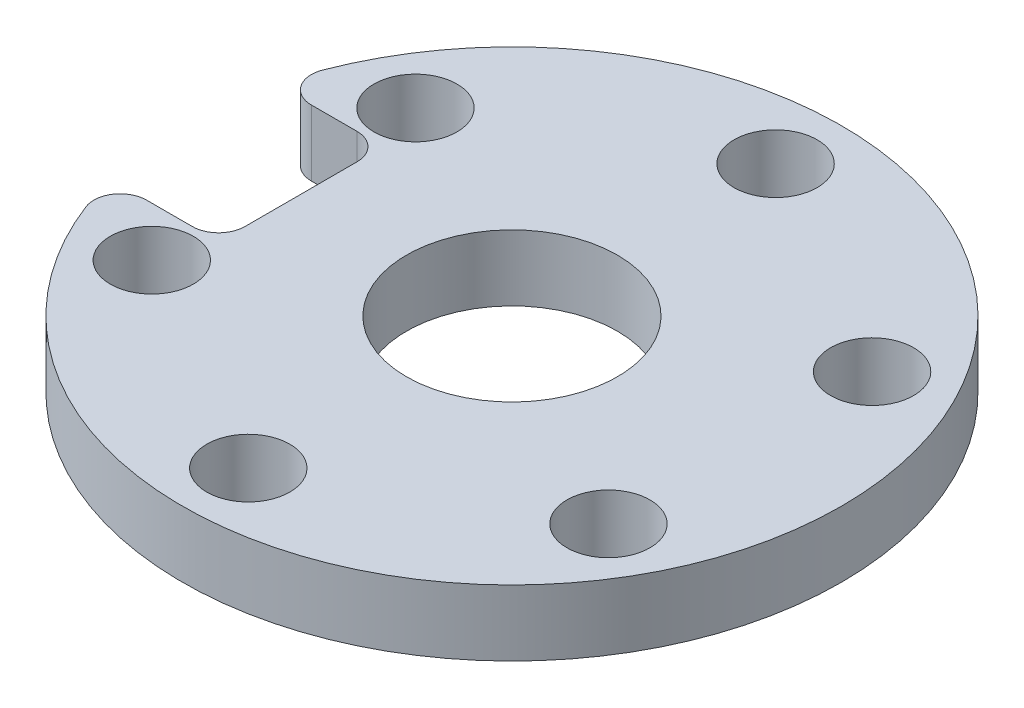
ISO-10303-21;
HEADER;
FILE_DESCRIPTION(('STEP AP214'),'2;1');
FILE_NAME('part.step','',(''),(''),'','','');
FILE_SCHEMA(('AUTOMOTIVE_DESIGN { 1 0 10303 214 1 1 1 1 }'));
ENDSEC;
DATA;
#1=APPLICATION_CONTEXT('core data for automotive mechanical design processes');
#2=APPLICATION_PROTOCOL_DEFINITION('international standard','automotive_design',2000,#1);
#3=PRODUCT_CONTEXT('',#1,'mechanical');
#4=PRODUCT('Part','Part','',(#3));
#5=PRODUCT_RELATED_PRODUCT_CATEGORY('part','',(#4));
#6=PRODUCT_DEFINITION_FORMATION('','',#4);
#7=PRODUCT_DEFINITION_CONTEXT('part definition',#1,'design');
#8=PRODUCT_DEFINITION('design','',#6,#7);
#9=PRODUCT_DEFINITION_SHAPE('','',#8);
#10=(LENGTH_UNIT() NAMED_UNIT(*) SI_UNIT(.MILLI.,.METRE.));
#11=(NAMED_UNIT(*) PLANE_ANGLE_UNIT() SI_UNIT($,.RADIAN.));
#12=(NAMED_UNIT(*) SI_UNIT($,.STERADIAN.) SOLID_ANGLE_UNIT());
#13=UNCERTAINTY_MEASURE_WITH_UNIT(LENGTH_MEASURE(1.E-05),#10,'distance_accuracy_value','');
#14=(GEOMETRIC_REPRESENTATION_CONTEXT(3) GLOBAL_UNCERTAINTY_ASSIGNED_CONTEXT((#13)) GLOBAL_UNIT_ASSIGNED_CONTEXT((#10,
#11,#12)) REPRESENTATION_CONTEXT('',''));
#15=CARTESIAN_POINT('',(0.,0.,0.));
#16=DIRECTION('',(0.,0.,1.));
#17=DIRECTION('',(1.,0.,0.));
#18=AXIS2_PLACEMENT_3D('',#15,#16,#17);
#19=CARTESIAN_POINT('',(0.,5.,0.));
#20=DIRECTION('',(0.,1.,0.));
#21=DIRECTION('',(0.,0.,1.));
#22=AXIS2_PLACEMENT_3D('',#19,#20,#21);
#23=PLANE('',#22);
#24=CARTESIAN_POINT('',(0.,5.,0.));
#25=DIRECTION('',(0.,1.,0.));
#26=DIRECTION('',(0.,0.,1.));
#27=AXIS2_PLACEMENT_3D('',#24,#25,#26);
#28=CIRCLE('',#27,8.);
#29=CARTESIAN_POINT('',(0.,5.,8.));
#30=VERTEX_POINT('',#29);
#31=EDGE_CURVE('E140',#30,#30,#28,.T.);
#32=ORIENTED_EDGE('',*,*,#31,.F.);
#33=EDGE_LOOP('',(#32));
#34=FACE_BOUND('',#33,.T.);
#35=CARTESIAN_POINT('',(-17.3205080756888,5.,10.));
#36=DIRECTION('',(0.,1.,0.));
#37=DIRECTION('',(0.,0.,1.));
#38=AXIS2_PLACEMENT_3D('',#35,#36,#37);
#39=CIRCLE('',#38,3.15);
#40=CARTESIAN_POINT('',(-17.3205080756888,5.,13.15));
#41=VERTEX_POINT('',#40);
#42=EDGE_CURVE('E155',#41,#41,#39,.T.);
#43=ORIENTED_EDGE('',*,*,#42,.F.);
#44=EDGE_LOOP('',(#43));
#45=FACE_BOUND('',#44,.T.);
#46=CARTESIAN_POINT('',(17.3205080756888,5.,10.));
#47=DIRECTION('',(0.,1.,0.));
#48=DIRECTION('',(0.,0.,1.));
#49=AXIS2_PLACEMENT_3D('',#46,#47,#48);
#50=CIRCLE('',#49,3.15);
#51=CARTESIAN_POINT('',(17.3205080756888,5.,13.15));
#52=VERTEX_POINT('',#51);
#53=EDGE_CURVE('E167',#52,#52,#50,.T.);
#54=ORIENTED_EDGE('',*,*,#53,.F.);
#55=EDGE_LOOP('',(#54));
#56=FACE_BOUND('',#55,.T.);
#57=CARTESIAN_POINT('',(0.,5.,-20.));
#58=DIRECTION('',(0.,1.,0.));
#59=DIRECTION('',(0.,0.,1.));
#60=AXIS2_PLACEMENT_3D('',#57,#58,#59);
#61=CIRCLE('',#60,3.15);
#62=CARTESIAN_POINT('',(0.,5.,-16.85));
#63=VERTEX_POINT('',#62);
#64=EDGE_CURVE('E179',#63,#63,#61,.T.);
#65=ORIENTED_EDGE('',*,*,#64,.F.);
#66=EDGE_LOOP('',(#65));
#67=FACE_BOUND('',#66,.T.);
#68=CARTESIAN_POINT('',(17.3205080756888,5.,-10.));
#69=DIRECTION('',(0.,1.,0.));
#70=DIRECTION('',(0.,0.,1.));
#71=AXIS2_PLACEMENT_3D('',#68,#69,#70);
#72=CIRCLE('',#71,3.15);
#73=CARTESIAN_POINT('',(17.3205080756888,5.,-6.85000000000001));
#74=VERTEX_POINT('',#73);
#75=EDGE_CURVE('E173',#74,#74,#72,.T.);
#76=ORIENTED_EDGE('',*,*,#75,.F.);
#77=EDGE_LOOP('',(#76));
#78=FACE_BOUND('',#77,.T.);
#79=CARTESIAN_POINT('',(0.,5.,20.));
#80=DIRECTION('',(0.,1.,0.));
#81=DIRECTION('',(0.,0.,1.));
#82=AXIS2_PLACEMENT_3D('',#79,#80,#81);
#83=CIRCLE('',#82,3.15);
#84=CARTESIAN_POINT('',(0.,5.,23.15));
#85=VERTEX_POINT('',#84);
#86=EDGE_CURVE('E161',#85,#85,#83,.T.);
#87=ORIENTED_EDGE('',*,*,#86,.F.);
#88=EDGE_LOOP('',(#87));
#89=FACE_BOUND('',#88,.T.);
#90=CARTESIAN_POINT('',(-17.3205080756888,5.,-9.99999999999999));
#91=DIRECTION('',(0.,1.,0.));
#92=DIRECTION('',(0.,0.,1.));
#93=AXIS2_PLACEMENT_3D('',#90,#91,#92);
#94=CIRCLE('',#93,3.15);
#95=CARTESIAN_POINT('',(-17.3205080756888,5.,-6.84999999999999));
#96=VERTEX_POINT('',#95);
#97=EDGE_CURVE('E149',#96,#96,#94,.T.);
#98=ORIENTED_EDGE('',*,*,#97,.F.);
#99=EDGE_LOOP('',(#98));
#100=FACE_BOUND('',#99,.T.);
#101=DIRECTION('',(1.,0.,0.));
#102=VECTOR('',#101,1.);
#103=CARTESIAN_POINT('',(-25.,5.,6.25));
#104=LINE('',#103,#102);
#105=CARTESIAN_POINT('',(-21.4694550466471,5.,6.25));
#106=VERTEX_POINT('',#105);
#107=CARTESIAN_POINT('',(-18.,5.,6.25));
#108=VERTEX_POINT('',#107);
#109=EDGE_CURVE('E121',#106,#108,#104,.T.);
#110=ORIENTED_EDGE('',*,*,#109,.F.);
#111=CARTESIAN_POINT('',(-21.4694550466471,5.,8.25));
#112=DIRECTION('',(0.,1.,0.));
#113=DIRECTION('',(0.,0.,1.));
#114=AXIS2_PLACEMENT_3D('',#111,#112,#113);
#115=CIRCLE('',#114,2.);
#116=CARTESIAN_POINT('',(-23.3363641811381,5.,8.96739130434783));
#117=VERTEX_POINT('',#116);
#118=EDGE_CURVE('E103',#106,#117,#115,.T.);
#119=ORIENTED_EDGE('',*,*,#118,.T.);
#120=CARTESIAN_POINT('',(0.,5.,0.));
#121=DIRECTION('',(0.,1.,0.));
#122=DIRECTION('',(0.,0.,1.));
#123=AXIS2_PLACEMENT_3D('',#120,#121,#122);
#124=CIRCLE('',#123,25.);
#125=CARTESIAN_POINT('',(-23.3363641811381,5.,-8.96739130434783));
#126=VERTEX_POINT('',#125);
#127=EDGE_CURVE('E126',#117,#126,#124,.T.);
#128=ORIENTED_EDGE('',*,*,#127,.T.);
#129=CARTESIAN_POINT('',(-21.4694550466471,5.,-8.25));
#130=DIRECTION('',(0.,1.,0.));
#131=DIRECTION('',(0.,0.,1.));
#132=AXIS2_PLACEMENT_3D('',#129,#130,#131);
#133=CIRCLE('',#132,2.);
#134=CARTESIAN_POINT('',(-21.4694550466471,5.,-6.25));
#135=VERTEX_POINT('',#134);
#136=EDGE_CURVE('E114',#126,#135,#133,.T.);
#137=ORIENTED_EDGE('',*,*,#136,.T.);
#138=DIRECTION('',(-1.,0.,0.));
#139=VECTOR('',#138,1.);
#140=CARTESIAN_POINT('',(-25.,5.,-6.25));
#141=LINE('',#140,#139);
#142=CARTESIAN_POINT('',(-18.,5.,-6.25));
#143=VERTEX_POINT('',#142);
#144=EDGE_CURVE('E135',#143,#135,#141,.T.);
#145=ORIENTED_EDGE('',*,*,#144,.F.);
#146=CARTESIAN_POINT('',(-18.,5.,-4.25));
#147=DIRECTION('',(0.,1.,0.));
#148=DIRECTION('',(0.,0.,1.));
#149=AXIS2_PLACEMENT_3D('',#146,#147,#148);
#150=CIRCLE('',#149,2.);
#151=CARTESIAN_POINT('',(-16.,5.,-4.25));
#152=VERTEX_POINT('',#151);
#153=EDGE_CURVE('E11',#143,#152,#150,.F.);
#154=ORIENTED_EDGE('',*,*,#153,.T.);
#155=DIRECTION('',(0.,0.,-1.));
#156=VECTOR('',#155,1.);
#157=CARTESIAN_POINT('',(-16.,5.,-6.25));
#158=LINE('',#157,#156);
#159=CARTESIAN_POINT('',(-16.,5.,4.25));
#160=VERTEX_POINT('',#159);
#161=EDGE_CURVE('E131',#160,#152,#158,.T.);
#162=ORIENTED_EDGE('',*,*,#161,.F.);
#163=CARTESIAN_POINT('',(-18.,5.,4.25));
#164=DIRECTION('',(0.,1.,0.));
#165=DIRECTION('',(0.,0.,1.));
#166=AXIS2_PLACEMENT_3D('',#163,#164,#165);
#167=CIRCLE('',#166,2.);
#168=EDGE_CURVE('E130',#160,#108,#167,.F.);
#169=ORIENTED_EDGE('',*,*,#168,.T.);
#170=EDGE_LOOP('',(#110,#119,#128,#137,#145,#154,#162,#169));
#171=FACE_BOUND('',#170,.T.);
#172=ADVANCED_FACE('F38',(#34,#45,#56,#67,#78,#89,#100,#171),#23,.T.);
#173=CARTESIAN_POINT('',(0.,0.,0.));
#174=DIRECTION('',(0.,1.,0.));
#175=DIRECTION('',(0.,0.,1.));
#176=AXIS2_PLACEMENT_3D('',#173,#174,#175);
#177=PLANE('',#176);
#178=CARTESIAN_POINT('',(0.,0.,0.));
#179=DIRECTION('',(0.,1.,0.));
#180=DIRECTION('',(0.,0.,1.));
#181=AXIS2_PLACEMENT_3D('',#178,#179,#180);
#182=CIRCLE('',#181,8.);
#183=CARTESIAN_POINT('',(0.,0.,8.));
#184=VERTEX_POINT('',#183);
#185=EDGE_CURVE('E147',#184,#184,#182,.T.);
#186=ORIENTED_EDGE('',*,*,#185,.T.);
#187=EDGE_LOOP('',(#186));
#188=FACE_BOUND('',#187,.T.);
#189=CARTESIAN_POINT('',(-17.3205080756888,0.,-9.99999999999999));
#190=DIRECTION('',(0.,1.,0.));
#191=DIRECTION('',(0.,0.,1.));
#192=AXIS2_PLACEMENT_3D('',#189,#190,#191);
#193=CIRCLE('',#192,3.15);
#194=CARTESIAN_POINT('',(-17.3205080756888,0.,-6.84999999999999));
#195=VERTEX_POINT('',#194);
#196=EDGE_CURVE('E145',#195,#195,#193,.T.);
#197=ORIENTED_EDGE('',*,*,#196,.T.);
#198=EDGE_LOOP('',(#197));
#199=FACE_BOUND('',#198,.T.);
#200=CARTESIAN_POINT('',(-17.3205080756888,0.,10.));
#201=DIRECTION('',(0.,1.,0.));
#202=DIRECTION('',(0.,0.,1.));
#203=AXIS2_PLACEMENT_3D('',#200,#201,#202);
#204=CIRCLE('',#203,3.15);
#205=CARTESIAN_POINT('',(-17.3205080756888,0.,13.15));
#206=VERTEX_POINT('',#205);
#207=EDGE_CURVE('E152',#206,#206,#204,.T.);
#208=ORIENTED_EDGE('',*,*,#207,.T.);
#209=EDGE_LOOP('',(#208));
#210=FACE_BOUND('',#209,.T.);
#211=CARTESIAN_POINT('',(0.,0.,20.));
#212=DIRECTION('',(0.,1.,0.));
#213=DIRECTION('',(0.,0.,1.));
#214=AXIS2_PLACEMENT_3D('',#211,#212,#213);
#215=CIRCLE('',#214,3.15);
#216=CARTESIAN_POINT('',(0.,0.,23.15));
#217=VERTEX_POINT('',#216);
#218=EDGE_CURVE('E158',#217,#217,#215,.T.);
#219=ORIENTED_EDGE('',*,*,#218,.T.);
#220=EDGE_LOOP('',(#219));
#221=FACE_BOUND('',#220,.T.);
#222=CARTESIAN_POINT('',(17.3205080756888,0.,10.));
#223=DIRECTION('',(0.,1.,0.));
#224=DIRECTION('',(0.,0.,1.));
#225=AXIS2_PLACEMENT_3D('',#222,#223,#224);
#226=CIRCLE('',#225,3.15);
#227=CARTESIAN_POINT('',(17.3205080756888,0.,13.15));
#228=VERTEX_POINT('',#227);
#229=EDGE_CURVE('E164',#228,#228,#226,.T.);
#230=ORIENTED_EDGE('',*,*,#229,.T.);
#231=EDGE_LOOP('',(#230));
#232=FACE_BOUND('',#231,.T.);
#233=CARTESIAN_POINT('',(17.3205080756888,0.,-10.));
#234=DIRECTION('',(0.,1.,0.));
#235=DIRECTION('',(0.,0.,1.));
#236=AXIS2_PLACEMENT_3D('',#233,#234,#235);
#237=CIRCLE('',#236,3.15);
#238=CARTESIAN_POINT('',(17.3205080756888,0.,-6.85000000000001));
#239=VERTEX_POINT('',#238);
#240=EDGE_CURVE('E170',#239,#239,#237,.T.);
#241=ORIENTED_EDGE('',*,*,#240,.T.);
#242=EDGE_LOOP('',(#241));
#243=FACE_BOUND('',#242,.T.);
#244=CARTESIAN_POINT('',(0.,0.,-20.));
#245=DIRECTION('',(0.,1.,0.));
#246=DIRECTION('',(0.,0.,1.));
#247=AXIS2_PLACEMENT_3D('',#244,#245,#246);
#248=CIRCLE('',#247,3.15);
#249=CARTESIAN_POINT('',(0.,0.,-16.85));
#250=VERTEX_POINT('',#249);
#251=EDGE_CURVE('E176',#250,#250,#248,.T.);
#252=ORIENTED_EDGE('',*,*,#251,.T.);
#253=EDGE_LOOP('',(#252));
#254=FACE_BOUND('',#253,.T.);
#255=CARTESIAN_POINT('',(0.,0.,0.));
#256=DIRECTION('',(0.,1.,0.));
#257=DIRECTION('',(0.,0.,1.));
#258=AXIS2_PLACEMENT_3D('',#255,#256,#257);
#259=CIRCLE('',#258,25.);
#260=CARTESIAN_POINT('',(-23.3363641811381,0.,8.96739130434783));
#261=VERTEX_POINT('',#260);
#262=CARTESIAN_POINT('',(-23.3363641811381,0.,-8.96739130434783));
#263=VERTEX_POINT('',#262);
#264=EDGE_CURVE('E182',#261,#263,#259,.T.);
#265=ORIENTED_EDGE('',*,*,#264,.F.);
#266=CARTESIAN_POINT('',(-21.4694550466471,0.,8.25));
#267=DIRECTION('',(0.,1.,0.));
#268=DIRECTION('',(0.,0.,1.));
#269=AXIS2_PLACEMENT_3D('',#266,#267,#268);
#270=CIRCLE('',#269,2.);
#271=CARTESIAN_POINT('',(-21.4694550466471,0.,6.25));
#272=VERTEX_POINT('',#271);
#273=EDGE_CURVE('E198',#261,#272,#270,.F.);
#274=ORIENTED_EDGE('',*,*,#273,.T.);
#275=DIRECTION('',(1.,0.,0.));
#276=VECTOR('',#275,1.);
#277=CARTESIAN_POINT('',(-25.,0.,6.25));
#278=LINE('',#277,#276);
#279=CARTESIAN_POINT('',(-18.,0.,6.25));
#280=VERTEX_POINT('',#279);
#281=EDGE_CURVE('E124',#272,#280,#278,.T.);
#282=ORIENTED_EDGE('',*,*,#281,.T.);
#283=CARTESIAN_POINT('',(-18.,0.,4.25));
#284=DIRECTION('',(0.,1.,0.));
#285=DIRECTION('',(0.,0.,1.));
#286=AXIS2_PLACEMENT_3D('',#283,#284,#285);
#287=CIRCLE('',#286,2.);
#288=CARTESIAN_POINT('',(-16.,0.,4.25));
#289=VERTEX_POINT('',#288);
#290=EDGE_CURVE('E204',#280,#289,#287,.T.);
#291=ORIENTED_EDGE('',*,*,#290,.T.);
#292=DIRECTION('',(0.,0.,-1.));
#293=VECTOR('',#292,1.);
#294=CARTESIAN_POINT('',(-16.,0.,-6.25));
#295=LINE('',#294,#293);
#296=CARTESIAN_POINT('',(-16.,0.,-4.25));
#297=VERTEX_POINT('',#296);
#298=EDGE_CURVE('E137',#289,#297,#295,.T.);
#299=ORIENTED_EDGE('',*,*,#298,.T.);
#300=CARTESIAN_POINT('',(-18.,0.,-4.25));
#301=DIRECTION('',(0.,1.,0.));
#302=DIRECTION('',(0.,0.,1.));
#303=AXIS2_PLACEMENT_3D('',#300,#301,#302);
#304=CIRCLE('',#303,2.);
#305=CARTESIAN_POINT('',(-18.,0.,-6.25));
#306=VERTEX_POINT('',#305);
#307=EDGE_CURVE('E46',#297,#306,#304,.T.);
#308=ORIENTED_EDGE('',*,*,#307,.T.);
#309=DIRECTION('',(-1.,0.,0.));
#310=VECTOR('',#309,1.);
#311=CARTESIAN_POINT('',(-25.,0.,-6.25));
#312=LINE('',#311,#310);
#313=CARTESIAN_POINT('',(-21.4694550466471,0.,-6.25));
#314=VERTEX_POINT('',#313);
#315=EDGE_CURVE('E132',#306,#314,#312,.T.);
#316=ORIENTED_EDGE('',*,*,#315,.T.);
#317=CARTESIAN_POINT('',(-21.4694550466471,0.,-8.25));
#318=DIRECTION('',(0.,1.,0.));
#319=DIRECTION('',(0.,0.,1.));
#320=AXIS2_PLACEMENT_3D('',#317,#318,#319);
#321=CIRCLE('',#320,2.);
#322=EDGE_CURVE('E53',#314,#263,#321,.F.);
#323=ORIENTED_EDGE('',*,*,#322,.T.);
#324=EDGE_LOOP('',(#265,#274,#282,#291,#299,#308,#316,#323));
#325=FACE_BOUND('',#324,.T.);
#326=ADVANCED_FACE('F208',(#188,#199,#210,#221,#232,#243,#254,#325),#177,.F.);
#327=CARTESIAN_POINT('',(0.,5.,0.));
#328=DIRECTION('',(0.,-1.,0.));
#329=DIRECTION('',(0.,0.,-1.));
#330=AXIS2_PLACEMENT_3D('',#327,#328,#329);
#331=CYLINDRICAL_SURFACE('',#330,25.);
#332=ORIENTED_EDGE('',*,*,#127,.F.);
#333=DIRECTION('',(0.,-1.,0.));
#334=VECTOR('',#333,1.);
#335=CARTESIAN_POINT('',(-23.3363641811381,5.,8.96739130434783));
#336=LINE('',#335,#334);
#337=EDGE_CURVE('E108',#117,#261,#336,.T.);
#338=ORIENTED_EDGE('',*,*,#337,.T.);
#339=ORIENTED_EDGE('',*,*,#264,.T.);
#340=DIRECTION('',(0.,-1.,0.));
#341=VECTOR('',#340,1.);
#342=CARTESIAN_POINT('',(-23.3363641811381,5.,-8.96739130434783));
#343=LINE('',#342,#341);
#344=EDGE_CURVE('E113',#263,#126,#343,.F.);
#345=ORIENTED_EDGE('',*,*,#344,.T.);
#346=EDGE_LOOP('',(#332,#338,#339,#345));
#347=FACE_BOUND('',#346,.T.);
#348=ADVANCED_FACE('F232',(#347),#331,.T.);
#349=CARTESIAN_POINT('',(0.,5.,-20.));
#350=DIRECTION('',(0.,-1.,0.));
#351=DIRECTION('',(0.,0.,-1.));
#352=AXIS2_PLACEMENT_3D('',#349,#350,#351);
#353=CYLINDRICAL_SURFACE('',#352,3.15);
#354=ORIENTED_EDGE('',*,*,#64,.T.);
#355=EDGE_LOOP('',(#354));
#356=FACE_BOUND('',#355,.T.);
#357=ORIENTED_EDGE('',*,*,#251,.F.);
#358=EDGE_LOOP('',(#357));
#359=FACE_BOUND('',#358,.T.);
#360=ADVANCED_FACE('F238',(#356,#359),#353,.F.);
#361=CARTESIAN_POINT('',(17.3205080756888,5.,-10.));
#362=DIRECTION('',(0.,-1.,0.));
#363=DIRECTION('',(0.,0.,-1.));
#364=AXIS2_PLACEMENT_3D('',#361,#362,#363);
#365=CYLINDRICAL_SURFACE('',#364,3.15);
#366=ORIENTED_EDGE('',*,*,#75,.T.);
#367=EDGE_LOOP('',(#366));
#368=FACE_BOUND('',#367,.T.);
#369=ORIENTED_EDGE('',*,*,#240,.F.);
#370=EDGE_LOOP('',(#369));
#371=FACE_BOUND('',#370,.T.);
#372=ADVANCED_FACE('F245',(#368,#371),#365,.F.);
#373=CARTESIAN_POINT('',(17.3205080756888,5.,10.));
#374=DIRECTION('',(0.,-1.,0.));
#375=DIRECTION('',(0.,0.,-1.));
#376=AXIS2_PLACEMENT_3D('',#373,#374,#375);
#377=CYLINDRICAL_SURFACE('',#376,3.15);
#378=ORIENTED_EDGE('',*,*,#53,.T.);
#379=EDGE_LOOP('',(#378));
#380=FACE_BOUND('',#379,.T.);
#381=ORIENTED_EDGE('',*,*,#229,.F.);
#382=EDGE_LOOP('',(#381));
#383=FACE_BOUND('',#382,.T.);
#384=ADVANCED_FACE('F336',(#380,#383),#377,.F.);
#385=CARTESIAN_POINT('',(0.,5.,20.));
#386=DIRECTION('',(0.,-1.,0.));
#387=DIRECTION('',(0.,0.,-1.));
#388=AXIS2_PLACEMENT_3D('',#385,#386,#387);
#389=CYLINDRICAL_SURFACE('',#388,3.15);
#390=ORIENTED_EDGE('',*,*,#86,.T.);
#391=EDGE_LOOP('',(#390));
#392=FACE_BOUND('',#391,.T.);
#393=ORIENTED_EDGE('',*,*,#218,.F.);
#394=EDGE_LOOP('',(#393));
#395=FACE_BOUND('',#394,.T.);
#396=ADVANCED_FACE('F325',(#392,#395),#389,.F.);
#397=CARTESIAN_POINT('',(-17.3205080756888,5.,10.));
#398=DIRECTION('',(0.,-1.,0.));
#399=DIRECTION('',(0.,0.,-1.));
#400=AXIS2_PLACEMENT_3D('',#397,#398,#399);
#401=CYLINDRICAL_SURFACE('',#400,3.15);
#402=ORIENTED_EDGE('',*,*,#42,.T.);
#403=EDGE_LOOP('',(#402));
#404=FACE_BOUND('',#403,.T.);
#405=ORIENTED_EDGE('',*,*,#207,.F.);
#406=EDGE_LOOP('',(#405));
#407=FACE_BOUND('',#406,.T.);
#408=ADVANCED_FACE('F315',(#404,#407),#401,.F.);
#409=CARTESIAN_POINT('',(-17.3205080756888,5.,-9.99999999999999));
#410=DIRECTION('',(0.,-1.,0.));
#411=DIRECTION('',(0.,0.,-1.));
#412=AXIS2_PLACEMENT_3D('',#409,#410,#411);
#413=CYLINDRICAL_SURFACE('',#412,3.15);
#414=ORIENTED_EDGE('',*,*,#97,.T.);
#415=EDGE_LOOP('',(#414));
#416=FACE_BOUND('',#415,.T.);
#417=ORIENTED_EDGE('',*,*,#196,.F.);
#418=EDGE_LOOP('',(#417));
#419=FACE_BOUND('',#418,.T.);
#420=ADVANCED_FACE('F297',(#416,#419),#413,.F.);
#421=CARTESIAN_POINT('',(-25.,5.,6.25));
#422=DIRECTION('',(0.,0.,-1.));
#423=DIRECTION('',(-1.,0.,0.));
#424=AXIS2_PLACEMENT_3D('',#421,#422,#423);
#425=PLANE('',#424);
#426=ORIENTED_EDGE('',*,*,#109,.T.);
#427=DIRECTION('',(0.,-1.,0.));
#428=VECTOR('',#427,1.);
#429=CARTESIAN_POINT('',(-18.,0.,6.25));
#430=LINE('',#429,#428);
#431=EDGE_CURVE('E125',#108,#280,#430,.T.);
#432=ORIENTED_EDGE('',*,*,#431,.T.);
#433=ORIENTED_EDGE('',*,*,#281,.F.);
#434=DIRECTION('',(0.,1.,0.));
#435=VECTOR('',#434,1.);
#436=CARTESIAN_POINT('',(-21.4694550466471,5.,6.25));
#437=LINE('',#436,#435);
#438=EDGE_CURVE('E107',#272,#106,#437,.T.);
#439=ORIENTED_EDGE('',*,*,#438,.T.);
#440=EDGE_LOOP('',(#426,#432,#433,#439));
#441=FACE_BOUND('',#440,.T.);
#442=ADVANCED_FACE('F119',(#441),#425,.T.);
#443=CARTESIAN_POINT('',(-25.,5.,-6.25));
#444=DIRECTION('',(0.,0.,1.));
#445=DIRECTION('',(1.,0.,0.));
#446=AXIS2_PLACEMENT_3D('',#443,#444,#445);
#447=PLANE('',#446);
#448=ORIENTED_EDGE('',*,*,#144,.T.);
#449=DIRECTION('',(0.,1.,0.));
#450=VECTOR('',#449,1.);
#451=CARTESIAN_POINT('',(-21.4694550466471,0.,-6.25));
#452=LINE('',#451,#450);
#453=EDGE_CURVE('E202',#135,#314,#452,.F.);
#454=ORIENTED_EDGE('',*,*,#453,.T.);
#455=ORIENTED_EDGE('',*,*,#315,.F.);
#456=DIRECTION('',(0.,-1.,0.));
#457=VECTOR('',#456,1.);
#458=CARTESIAN_POINT('',(-18.,5.,-6.25));
#459=LINE('',#458,#457);
#460=EDGE_CURVE('E200',#306,#143,#459,.F.);
#461=ORIENTED_EDGE('',*,*,#460,.T.);
#462=EDGE_LOOP('',(#448,#454,#455,#461));
#463=FACE_BOUND('',#462,.T.);
#464=ADVANCED_FACE('F223',(#463),#447,.T.);
#465=CARTESIAN_POINT('',(-16.,5.,-6.25));
#466=DIRECTION('',(-1.,0.,0.));
#467=DIRECTION('',(0.,0.,1.));
#468=AXIS2_PLACEMENT_3D('',#465,#466,#467);
#469=PLANE('',#468);
#470=ORIENTED_EDGE('',*,*,#298,.F.);
#471=DIRECTION('',(0.,-1.,0.));
#472=VECTOR('',#471,1.);
#473=CARTESIAN_POINT('',(-16.,5.,4.25));
#474=LINE('',#473,#472);
#475=EDGE_CURVE('E192',#289,#160,#474,.F.);
#476=ORIENTED_EDGE('',*,*,#475,.T.);
#477=ORIENTED_EDGE('',*,*,#161,.T.);
#478=DIRECTION('',(0.,-1.,0.));
#479=VECTOR('',#478,1.);
#480=CARTESIAN_POINT('',(-16.,0.,-4.25));
#481=LINE('',#480,#479);
#482=EDGE_CURVE('E189',#152,#297,#481,.T.);
#483=ORIENTED_EDGE('',*,*,#482,.T.);
#484=EDGE_LOOP('',(#470,#476,#477,#483));
#485=FACE_BOUND('',#484,.T.);
#486=ADVANCED_FACE('F212',(#485),#469,.T.);
#487=CARTESIAN_POINT('',(-18.,5.,4.25));
#488=DIRECTION('',(0.,1.,0.));
#489=DIRECTION('',(0.,0.,1.));
#490=AXIS2_PLACEMENT_3D('',#487,#488,#489);
#491=CYLINDRICAL_SURFACE('',#490,2.);
#492=ORIENTED_EDGE('',*,*,#168,.F.);
#493=ORIENTED_EDGE('',*,*,#475,.F.);
#494=ORIENTED_EDGE('',*,*,#290,.F.);
#495=ORIENTED_EDGE('',*,*,#431,.F.);
#496=EDGE_LOOP('',(#492,#493,#494,#495));
#497=FACE_BOUND('',#496,.T.);
#498=ADVANCED_FACE('F214',(#497),#491,.F.);
#499=CARTESIAN_POINT('',(-21.4694550466471,5.,8.25));
#500=DIRECTION('',(0.,-1.,0.));
#501=DIRECTION('',(0.,0.,-1.));
#502=AXIS2_PLACEMENT_3D('',#499,#500,#501);
#503=CYLINDRICAL_SURFACE('',#502,2.);
#504=ORIENTED_EDGE('',*,*,#273,.F.);
#505=ORIENTED_EDGE('',*,*,#337,.F.);
#506=ORIENTED_EDGE('',*,*,#118,.F.);
#507=ORIENTED_EDGE('',*,*,#438,.F.);
#508=EDGE_LOOP('',(#504,#505,#506,#507));
#509=FACE_BOUND('',#508,.T.);
#510=ADVANCED_FACE('F106',(#509),#503,.T.);
#511=CARTESIAN_POINT('',(-21.4694550466471,5.,-8.25));
#512=DIRECTION('',(0.,-1.,0.));
#513=DIRECTION('',(0.,0.,-1.));
#514=AXIS2_PLACEMENT_3D('',#511,#512,#513);
#515=CYLINDRICAL_SURFACE('',#514,2.);
#516=ORIENTED_EDGE('',*,*,#136,.F.);
#517=ORIENTED_EDGE('',*,*,#344,.F.);
#518=ORIENTED_EDGE('',*,*,#322,.F.);
#519=ORIENTED_EDGE('',*,*,#453,.F.);
#520=EDGE_LOOP('',(#516,#517,#518,#519));
#521=FACE_BOUND('',#520,.T.);
#522=ADVANCED_FACE('F221',(#521),#515,.T.);
#523=CARTESIAN_POINT('',(-18.,5.,-4.25));
#524=DIRECTION('',(0.,1.,0.));
#525=DIRECTION('',(0.,0.,1.));
#526=AXIS2_PLACEMENT_3D('',#523,#524,#525);
#527=CYLINDRICAL_SURFACE('',#526,2.);
#528=ORIENTED_EDGE('',*,*,#153,.F.);
#529=ORIENTED_EDGE('',*,*,#460,.F.);
#530=ORIENTED_EDGE('',*,*,#307,.F.);
#531=ORIENTED_EDGE('',*,*,#482,.F.);
#532=EDGE_LOOP('',(#528,#529,#530,#531));
#533=FACE_BOUND('',#532,.T.);
#534=ADVANCED_FACE('F40',(#533),#527,.F.);
#535=CARTESIAN_POINT('',(0.,0.,0.));
#536=DIRECTION('',(0.,1.,0.));
#537=DIRECTION('',(0.,0.,1.));
#538=AXIS2_PLACEMENT_3D('',#535,#536,#537);
#539=CYLINDRICAL_SURFACE('',#538,8.);
#540=ORIENTED_EDGE('',*,*,#185,.F.);
#541=EDGE_LOOP('',(#540));
#542=FACE_BOUND('',#541,.T.);
#543=ORIENTED_EDGE('',*,*,#31,.T.);
#544=EDGE_LOOP('',(#543));
#545=FACE_BOUND('',#544,.T.);
#546=ADVANCED_FACE('F254',(#542,#545),#539,.F.);
#547=CLOSED_SHELL('',(#172,#326,#348,#360,#372,#384,#396,#408,#420,#442,#464,#486,#498,#510,
#522,#534,#546));
#548=MANIFOLD_SOLID_BREP('B2',#547);
#549=ADVANCED_BREP_SHAPE_REPRESENTATION('',(#18,#548),#14);
#550=SHAPE_DEFINITION_REPRESENTATION(#9,#549);
ENDSEC;
END-ISO-10303-21;
